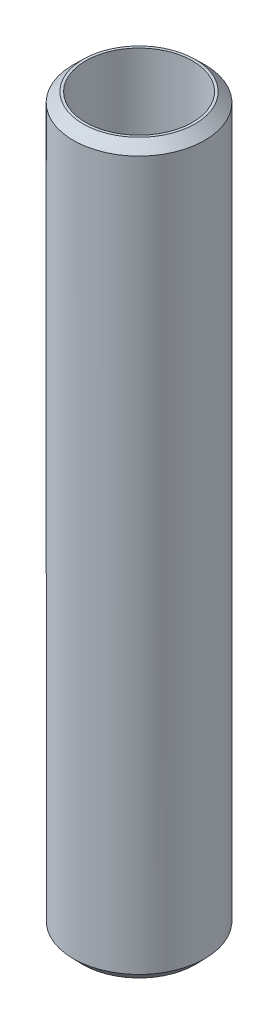
ISO-10303-21;
HEADER;
FILE_DESCRIPTION(('STEP AP214'),'2;1');
FILE_NAME('part.step','',(''),(''),'','','');
FILE_SCHEMA(('AUTOMOTIVE_DESIGN { 1 0 10303 214 1 1 1 1 }'));
ENDSEC;
DATA;
#1=APPLICATION_CONTEXT('core data for automotive mechanical design processes');
#2=APPLICATION_PROTOCOL_DEFINITION('international standard','automotive_design',2000,#1);
#3=PRODUCT_CONTEXT('',#1,'mechanical');
#4=PRODUCT('Part','Part','',(#3));
#5=PRODUCT_RELATED_PRODUCT_CATEGORY('part','',(#4));
#6=PRODUCT_DEFINITION_FORMATION('','',#4);
#7=PRODUCT_DEFINITION_CONTEXT('part definition',#1,'design');
#8=PRODUCT_DEFINITION('design','',#6,#7);
#9=PRODUCT_DEFINITION_SHAPE('','',#8);
#10=(LENGTH_UNIT() NAMED_UNIT(*) SI_UNIT(.MILLI.,.METRE.));
#11=(NAMED_UNIT(*) PLANE_ANGLE_UNIT() SI_UNIT($,.RADIAN.));
#12=(NAMED_UNIT(*) SI_UNIT($,.STERADIAN.) SOLID_ANGLE_UNIT());
#13=UNCERTAINTY_MEASURE_WITH_UNIT(LENGTH_MEASURE(1.E-05),#10,'distance_accuracy_value','');
#14=(GEOMETRIC_REPRESENTATION_CONTEXT(3) GLOBAL_UNCERTAINTY_ASSIGNED_CONTEXT((#13)) GLOBAL_UNIT_ASSIGNED_CONTEXT((#10,
#11,#12)) REPRESENTATION_CONTEXT('',''));
#15=CARTESIAN_POINT('',(0.,0.,0.));
#16=DIRECTION('',(0.,0.,1.));
#17=DIRECTION('',(1.,0.,0.));
#18=AXIS2_PLACEMENT_3D('',#15,#16,#17);
#19=CARTESIAN_POINT('',(0.,360.140918461262,0.));
#20=DIRECTION('',(0.,-1.,0.));
#21=DIRECTION('',(0.,0.,-1.));
#22=AXIS2_PLACEMENT_3D('',#19,#20,#21);
#23=CYLINDRICAL_SURFACE('',#22,32.5);
#24=CARTESIAN_POINT('',(0.,355.474037666963,0.));
#25=DIRECTION('',(0.,1.,0.));
#26=DIRECTION('',(0.,0.,1.));
#27=AXIS2_PLACEMENT_3D('',#24,#25,#26);
#28=CIRCLE('',#27,32.5);
#29=CARTESIAN_POINT('',(0.,355.474037666963,-32.5));
#30=VERTEX_POINT('',#29);
#31=EDGE_CURVE('E50',#30,#30,#28,.F.);
#32=CARTESIAN_POINT('',(0.,4.810373557804,0.));
#33=DIRECTION('',(0.,1.,0.));
#34=DIRECTION('',(0.,0.,1.));
#35=AXIS2_PLACEMENT_3D('',#32,#33,#34);
#36=CIRCLE('',#35,32.5);
#37=CARTESIAN_POINT('',(0.,4.81037355780395,-32.5));
#38=VERTEX_POINT('',#37);
#39=EDGE_CURVE('E51',#38,#38,#36,.T.);
#40=CARTESIAN_POINT('',(0.,355.474037666963,-32.5));
#41=CARTESIAN_POINT('',(0.,351.821291165826,-32.5));
#42=CARTESIAN_POINT('',(0.,348.168544664688,-32.5));
#43=CARTESIAN_POINT('',(0.,340.863051662414,-32.5));
#44=CARTESIAN_POINT('',(0.,337.210305161277,-32.5));
#45=CARTESIAN_POINT('',(0.,329.904812159003,-32.5));
#46=CARTESIAN_POINT('',(0.,326.252065657866,-32.5));
#47=CARTESIAN_POINT('',(0.,318.946572655592,-32.5));
#48=CARTESIAN_POINT('',(0.,315.293826154455,-32.5));
#49=CARTESIAN_POINT('',(0.,307.988333152181,-32.5));
#50=CARTESIAN_POINT('',(0.,304.335586651044,-32.5));
#51=CARTESIAN_POINT('',(0.,297.030093648769,-32.5));
#52=CARTESIAN_POINT('',(0.,293.377347147632,-32.5));
#53=CARTESIAN_POINT('',(0.,286.071854145358,-32.5));
#54=CARTESIAN_POINT('',(0.,282.419107644221,-32.5));
#55=CARTESIAN_POINT('',(0.,275.113614641947,-32.5));
#56=CARTESIAN_POINT('',(0.,271.46086814081,-32.5));
#57=CARTESIAN_POINT('',(0.,264.155375138536,-32.5));
#58=CARTESIAN_POINT('',(0.,260.502628637399,-32.5));
#59=CARTESIAN_POINT('',(0.,253.197135635125,-32.5));
#60=CARTESIAN_POINT('',(0.,249.544389133988,-32.5));
#61=CARTESIAN_POINT('',(0.,242.238896131713,-32.5));
#62=CARTESIAN_POINT('',(0.,238.586149630576,-32.5));
#63=CARTESIAN_POINT('',(0.,231.280656628302,-32.5));
#64=CARTESIAN_POINT('',(0.,227.627910127165,-32.5));
#65=CARTESIAN_POINT('',(0.,220.322417124891,-32.5));
#66=CARTESIAN_POINT('',(0.,216.669670623754,-32.5));
#67=CARTESIAN_POINT('',(0.,209.36417762148,-32.5));
#68=CARTESIAN_POINT('',(0.,205.711431120343,-32.5));
#69=CARTESIAN_POINT('',(0.,198.405938118069,-32.5));
#70=CARTESIAN_POINT('',(0.,194.753191616932,-32.5));
#71=CARTESIAN_POINT('',(0.,187.447698614657,-32.5));
#72=CARTESIAN_POINT('',(0.,183.79495211352,-32.5));
#73=CARTESIAN_POINT('',(0.,176.489459111246,-32.5));
#74=CARTESIAN_POINT('',(0.,172.836712610109,-32.5));
#75=CARTESIAN_POINT('',(0.,165.531219607835,-32.5));
#76=CARTESIAN_POINT('',(0.,161.878473106698,-32.5));
#77=CARTESIAN_POINT('',(0.,154.572980104424,-32.5));
#78=CARTESIAN_POINT('',(0.,150.920233603287,-32.5));
#79=CARTESIAN_POINT('',(0.,143.614740601013,-32.5));
#80=CARTESIAN_POINT('',(0.,139.961994099876,-32.5));
#81=CARTESIAN_POINT('',(0.,132.656501097601,-32.5));
#82=CARTESIAN_POINT('',(0.,129.003754596464,-32.5));
#83=CARTESIAN_POINT('',(0.,121.69826159419,-32.5));
#84=CARTESIAN_POINT('',(0.,118.045515093053,-32.5));
#85=CARTESIAN_POINT('',(0.,110.740022090779,-32.5));
#86=CARTESIAN_POINT('',(0.,107.087275589642,-32.5));
#87=CARTESIAN_POINT('',(0.,99.7817825873678,-32.5));
#88=CARTESIAN_POINT('',(0.,96.1290360862307,-32.5));
#89=CARTESIAN_POINT('',(0.,88.8235430839566,-32.5));
#90=CARTESIAN_POINT('',(0.,85.1707965828195,-32.5));
#91=CARTESIAN_POINT('',(0.,77.8653035805453,-32.5));
#92=CARTESIAN_POINT('',(0.,74.2125570794083,-32.5));
#93=CARTESIAN_POINT('',(0.,66.9070640771341,-32.5));
#94=CARTESIAN_POINT('',(0.,63.254317575997,-32.5));
#95=CARTESIAN_POINT('',(0.,55.9488245737229,-32.5));
#96=CARTESIAN_POINT('',(0.,52.2960780725858,-32.5));
#97=CARTESIAN_POINT('',(0.,44.9905850703117,-32.5));
#98=CARTESIAN_POINT('',(0.,41.3378385691746,-32.5));
#99=CARTESIAN_POINT('',(0.,34.0323455669005,-32.5));
#100=CARTESIAN_POINT('',(0.,30.3795990657634,-32.5));
#101=CARTESIAN_POINT('',(0.,23.0741060634893,-32.5));
#102=CARTESIAN_POINT('',(0.,19.4213595623522,-32.5));
#103=CARTESIAN_POINT('',(0.,12.1158665600781,-32.5));
#104=CARTESIAN_POINT('',(0.,8.46312005894101,-32.5));
#105=CARTESIAN_POINT('',(0.,4.81037355780395,-32.5));
#106=B_SPLINE_CURVE_WITH_KNOTS('',3,(#40,#41,#42,#43,#44,#45,#46,#47,#48,#49,#50,#51,#52,#53,
#54,#55,#56,#57,#58,#59,#60,#61,#62,#63,#64,#65,#66,#67,#68,#69,#70,#71,#72,#73,#74,#75,#76,#77,
#78,#79,#80,#81,#82,#83,#84,#85,#86,#87,#88,#89,#90,#91,#92,#93,#94,#95,#96,#97,#98,#99,#100,
#101,#102,#103,#104,#105),.UNSPECIFIED.,.F.,.F.,(4,2,2,2,2,2,2,2,2,2,2,2,2,2,2,2,2,2,2,2,2,2,2,
2,2,2,2,2,2,2,2,2,4),(0.,10.9582395034112,21.9164790068224,32.8747185102336,43.8329580136448,
54.791197517056,65.7494370204672,76.7076765238784,87.6659160272896,98.6241555307009,
109.582395034112,120.540634537523,131.498874040934,142.457113544346,153.415353047757,
164.373592551168,175.331832054579,186.290071557991,197.248311061402,208.206550564813,
219.164790068224,230.123029571635,241.081269075047,252.039508578458,262.997748081869,
273.95598758528,284.914227088691,295.872466592103,306.830706095514,317.788945598925,
328.747185102336,339.705424605747,350.663664109159),.UNSPECIFIED.);
#107=EDGE_CURVE('BSEAM39',#30,#38,#106,.T.);
#108=ORIENTED_EDGE('',*,*,#31,.T.);
#109=ORIENTED_EDGE('',*,*,#39,.T.);
#110=ORIENTED_EDGE('',*,*,#107,.T.);
#111=ORIENTED_EDGE('',*,*,#107,.F.);
#112=EDGE_LOOP('',(#108,#110,#109,#111));
#113=FACE_BOUND('',#112,.T.);
#114=ADVANCED_FACE('F39',(#113),#23,.T.);
#115=CARTESIAN_POINT('',(0.,360.140918461262,0.));
#116=DIRECTION('',(0.,1.,0.));
#117=DIRECTION('',(0.,0.,1.));
#118=AXIS2_PLACEMENT_3D('',#115,#116,#117);
#119=PLANE('',#118);
#120=CARTESIAN_POINT('',(0.,360.140918461262,0.));
#121=DIRECTION('',(0.,1.,0.));
#122=DIRECTION('',(0.,0.,1.));
#123=AXIS2_PLACEMENT_3D('',#120,#121,#122);
#124=CIRCLE('',#123,27.6896264421965);
#125=CARTESIAN_POINT('',(0.,360.140918461262,27.6896264421965));
#126=VERTEX_POINT('',#125);
#127=EDGE_CURVE('E54',#126,#126,#124,.T.);
#128=ORIENTED_EDGE('',*,*,#127,.T.);
#129=EDGE_LOOP('',(#128));
#130=FACE_BOUND('',#129,.T.);
#131=CARTESIAN_POINT('',(0.,360.140918461262,0.));
#132=DIRECTION('',(0.,1.,0.));
#133=DIRECTION('',(0.,0.,1.));
#134=AXIS2_PLACEMENT_3D('',#131,#132,#133);
#135=CIRCLE('',#134,26.4204466912498);
#136=CARTESIAN_POINT('',(0.,360.140918461262,-26.4204466912498));
#137=VERTEX_POINT('',#136);
#138=EDGE_CURVE('E58',#137,#137,#135,.T.);
#139=ORIENTED_EDGE('',*,*,#138,.F.);
#140=EDGE_LOOP('',(#139));
#141=FACE_BOUND('',#140,.T.);
#142=ADVANCED_FACE('F69',(#130,#141),#119,.T.);
#143=CARTESIAN_POINT('',(0.,0.,0.));
#144=DIRECTION('',(0.,1.,0.));
#145=DIRECTION('',(0.,0.,1.));
#146=AXIS2_PLACEMENT_3D('',#143,#144,#145);
#147=PLANE('',#146);
#148=CARTESIAN_POINT('',(0.,0.,0.));
#149=DIRECTION('',(0.,1.,0.));
#150=DIRECTION('',(0.,0.,1.));
#151=AXIS2_PLACEMENT_3D('',#148,#149,#150);
#152=CIRCLE('',#151,27.8331192057003);
#153=CARTESIAN_POINT('',(0.,0.,27.8331192057003));
#154=VERTEX_POINT('',#153);
#155=EDGE_CURVE('E10',#154,#154,#152,.F.);
#156=ORIENTED_EDGE('',*,*,#155,.T.);
#157=EDGE_LOOP('',(#156));
#158=FACE_BOUND('',#157,.T.);
#159=CARTESIAN_POINT('',(0.,0.,0.));
#160=DIRECTION('',(0.,1.,0.));
#161=DIRECTION('',(0.,0.,1.));
#162=AXIS2_PLACEMENT_3D('',#159,#160,#161);
#163=CIRCLE('',#162,26.4204466912498);
#164=CARTESIAN_POINT('',(0.,0.,-26.4204466912498));
#165=VERTEX_POINT('',#164);
#166=EDGE_CURVE('E63',#165,#165,#163,.T.);
#167=ORIENTED_EDGE('',*,*,#166,.T.);
#168=EDGE_LOOP('',(#167));
#169=FACE_BOUND('',#168,.T.);
#170=ADVANCED_FACE('F75',(#158,#169),#147,.F.);
#171=CARTESIAN_POINT('',(0.,360.140918461262,0.));
#172=DIRECTION('',(0.,-1.,0.));
#173=DIRECTION('',(0.,0.,-1.));
#174=AXIS2_PLACEMENT_3D('',#171,#172,#173);
#175=CYLINDRICAL_SURFACE('',#174,26.4204466912498);
#176=CARTESIAN_POINT('',(0.,360.140918461262,-26.4204466912498));
#177=CARTESIAN_POINT('',(0.,356.389450560624,-26.4204466912498));
#178=CARTESIAN_POINT('',(0.,352.637982659986,-26.4204466912498));
#179=CARTESIAN_POINT('',(0.,345.135046858709,-26.4204466912498));
#180=CARTESIAN_POINT('',(0.,341.383578958071,-26.4204466912498));
#181=CARTESIAN_POINT('',(0.,333.880643156795,-26.4204466912498));
#182=CARTESIAN_POINT('',(0.,330.129175256157,-26.4204466912498));
#183=CARTESIAN_POINT('',(0.,322.62623945488,-26.4204466912498));
#184=CARTESIAN_POINT('',(0.,318.874771554242,-26.4204466912498));
#185=CARTESIAN_POINT('',(0.,311.371835752966,-26.4204466912498));
#186=CARTESIAN_POINT('',(0.,307.620367852328,-26.4204466912498));
#187=CARTESIAN_POINT('',(0.,300.117432051052,-26.4204466912498));
#188=CARTESIAN_POINT('',(0.,296.365964150413,-26.4204466912498));
#189=CARTESIAN_POINT('',(0.,288.863028349137,-26.4204466912498));
#190=CARTESIAN_POINT('',(0.,285.111560448499,-26.4204466912498));
#191=CARTESIAN_POINT('',(0.,277.608624647223,-26.4204466912498));
#192=CARTESIAN_POINT('',(0.,273.857156746585,-26.4204466912498));
#193=CARTESIAN_POINT('',(0.,266.354220945308,-26.4204466912498));
#194=CARTESIAN_POINT('',(0.,262.60275304467,-26.4204466912498));
#195=CARTESIAN_POINT('',(0.,255.099817243394,-26.4204466912498));
#196=CARTESIAN_POINT('',(0.,251.348349342756,-26.4204466912498));
#197=CARTESIAN_POINT('',(0.,243.845413541479,-26.4204466912498));
#198=CARTESIAN_POINT('',(0.,240.093945640841,-26.4204466912498));
#199=CARTESIAN_POINT('',(0.,232.591009839565,-26.4204466912498));
#200=CARTESIAN_POINT('',(0.,228.839541938927,-26.4204466912498));
#201=CARTESIAN_POINT('',(0.,221.336606137651,-26.4204466912498));
#202=CARTESIAN_POINT('',(0.,217.585138237012,-26.4204466912498));
#203=CARTESIAN_POINT('',(0.,210.082202435736,-26.4204466912498));
#204=CARTESIAN_POINT('',(0.,206.330734535098,-26.4204466912498));
#205=CARTESIAN_POINT('',(0.,198.827798733822,-26.4204466912498));
#206=CARTESIAN_POINT('',(0.,195.076330833184,-26.4204466912498));
#207=CARTESIAN_POINT('',(0.,187.573395031907,-26.4204466912498));
#208=CARTESIAN_POINT('',(0.,183.821927131269,-26.4204466912498));
#209=CARTESIAN_POINT('',(0.,176.318991329993,-26.4204466912498));
#210=CARTESIAN_POINT('',(0.,172.567523429355,-26.4204466912498));
#211=CARTESIAN_POINT('',(0.,165.064587628078,-26.4204466912498));
#212=CARTESIAN_POINT('',(0.,161.31311972744,-26.4204466912498));
#213=CARTESIAN_POINT('',(0.,153.810183926164,-26.4204466912498));
#214=CARTESIAN_POINT('',(0.,150.058716025526,-26.4204466912498));
#215=CARTESIAN_POINT('',(0.,142.555780224249,-26.4204466912498));
#216=CARTESIAN_POINT('',(0.,138.804312323611,-26.4204466912498));
#217=CARTESIAN_POINT('',(0.,131.301376522335,-26.4204466912498));
#218=CARTESIAN_POINT('',(0.,127.549908621697,-26.4204466912498));
#219=CARTESIAN_POINT('',(0.,120.046972820421,-26.4204466912498));
#220=CARTESIAN_POINT('',(0.,116.295504919782,-26.4204466912498));
#221=CARTESIAN_POINT('',(0.,108.792569118506,-26.4204466912498));
#222=CARTESIAN_POINT('',(0.,105.041101217868,-26.4204466912498));
#223=CARTESIAN_POINT('',(0.,97.5381654165918,-26.4204466912498));
#224=CARTESIAN_POINT('',(0.,93.7866975159536,-26.4204466912498));
#225=CARTESIAN_POINT('',(0.,86.2837617146773,-26.4204466912498));
#226=CARTESIAN_POINT('',(0.,82.5322938140392,-26.4204466912498));
#227=CARTESIAN_POINT('',(0.,75.0293580127629,-26.4204466912498));
#228=CARTESIAN_POINT('',(0.,71.2778901121247,-26.4204466912498));
#229=CARTESIAN_POINT('',(0.,63.7749543108484,-26.4204466912498));
#230=CARTESIAN_POINT('',(0.,60.0234864102103,-26.4204466912498));
#231=CARTESIAN_POINT('',(0.,52.520550608934,-26.4204466912498));
#232=CARTESIAN_POINT('',(0.,48.7690827082958,-26.4204466912498));
#233=CARTESIAN_POINT('',(0.,41.2661469070196,-26.4204466912498));
#234=CARTESIAN_POINT('',(0.,37.5146790063814,-26.4204466912498));
#235=CARTESIAN_POINT('',(0.,30.0117432051051,-26.4204466912498));
#236=CARTESIAN_POINT('',(0.,26.260275304467,-26.4204466912498));
#237=CARTESIAN_POINT('',(0.,18.7573395031907,-26.4204466912498));
#238=CARTESIAN_POINT('',(0.,15.0058716025525,-26.4204466912498));
#239=CARTESIAN_POINT('',(0.,7.50293580127624,-26.4204466912498));
#240=CARTESIAN_POINT('',(0.,3.75146790063809,-26.4204466912498));
#241=CARTESIAN_POINT('',(0.,0.,-26.4204466912498));
#242=B_SPLINE_CURVE_WITH_KNOTS('',3,(#176,#177,#178,#179,#180,#181,#182,#183,#184,#185,#186,
#187,#188,#189,#190,#191,#192,#193,#194,#195,#196,#197,#198,#199,#200,#201,#202,#203,#204,#205,
#206,#207,#208,#209,#210,#211,#212,#213,#214,#215,#216,#217,#218,#219,#220,#221,#222,#223,#224,
#225,#226,#227,#228,#229,#230,#231,#232,#233,#234,#235,#236,#237,#238,#239,#240,#241),
.UNSPECIFIED.,.F.,.F.,(4,2,2,2,2,2,2,2,2,2,2,2,2,2,2,2,2,2,2,2,2,2,2,2,2,2,2,2,2,2,2,2,4),(0.,
11.2544037019144,22.5088074038289,33.7632111057433,45.0176148076578,56.2720185095722,
67.5264222114866,78.7808259134011,90.0352296153155,101.28963331723,112.544037019144,
123.798440721059,135.052844422973,146.307248124888,157.561651826802,168.816055528717,
180.070459230631,191.324862932545,202.57926663446,213.833670336374,225.088074038289,
236.342477740203,247.596881442118,258.851285144032,270.105688845946,281.360092547861,
292.614496249775,303.86889995169,315.123303653604,326.377707355519,337.632111057433,
348.886514759348,360.140918461262),.UNSPECIFIED.);
#243=EDGE_CURVE('BSEAM70',#137,#165,#242,.T.);
#244=ORIENTED_EDGE('',*,*,#138,.T.);
#245=ORIENTED_EDGE('',*,*,#166,.F.);
#246=ORIENTED_EDGE('',*,*,#243,.T.);
#247=ORIENTED_EDGE('',*,*,#243,.F.);
#248=EDGE_LOOP('',(#244,#246,#245,#247));
#249=FACE_BOUND('',#248,.T.);
#250=ADVANCED_FACE('F70',(#249),#175,.F.);
#251=CARTESIAN_POINT('',(0.,360.140918461262,0.));
#252=DIRECTION('',(0.,-1.,0.));
#253=DIRECTION('',(0.,0.,-1.));
#254=AXIS2_PLACEMENT_3D('',#251,#252,#253);
#255=CONICAL_SURFACE('',#254,27.6896264421965,0.800537759192472);
#256=ORIENTED_EDGE('',*,*,#31,.F.);
#257=EDGE_LOOP('',(#256));
#258=FACE_BOUND('',#257,.T.);
#259=ORIENTED_EDGE('',*,*,#127,.F.);
#260=EDGE_LOOP('',(#259));
#261=FACE_BOUND('',#260,.T.);
#262=ADVANCED_FACE('F81',(#258,#261),#255,.T.);
#263=CARTESIAN_POINT('',(0.,4.810373557804,0.));
#264=DIRECTION('',(0.,1.,0.));
#265=DIRECTION('',(0.,0.,1.));
#266=AXIS2_PLACEMENT_3D('',#263,#264,#265);
#267=CONICAL_SURFACE('',#266,32.5,0.770258567602418);
#268=ORIENTED_EDGE('',*,*,#155,.F.);
#269=EDGE_LOOP('',(#268));
#270=FACE_BOUND('',#269,.T.);
#271=ORIENTED_EDGE('',*,*,#39,.F.);
#272=EDGE_LOOP('',(#271));
#273=FACE_BOUND('',#272,.T.);
#274=ADVANCED_FACE('F45',(#270,#273),#267,.T.);
#275=CLOSED_SHELL('',(#114,#142,#170,#250,#262,#274));
#276=MANIFOLD_SOLID_BREP('B2',#275);
#277=ADVANCED_BREP_SHAPE_REPRESENTATION('',(#18,#276),#14);
#278=SHAPE_DEFINITION_REPRESENTATION(#9,#277);
ENDSEC;
END-ISO-10303-21;
